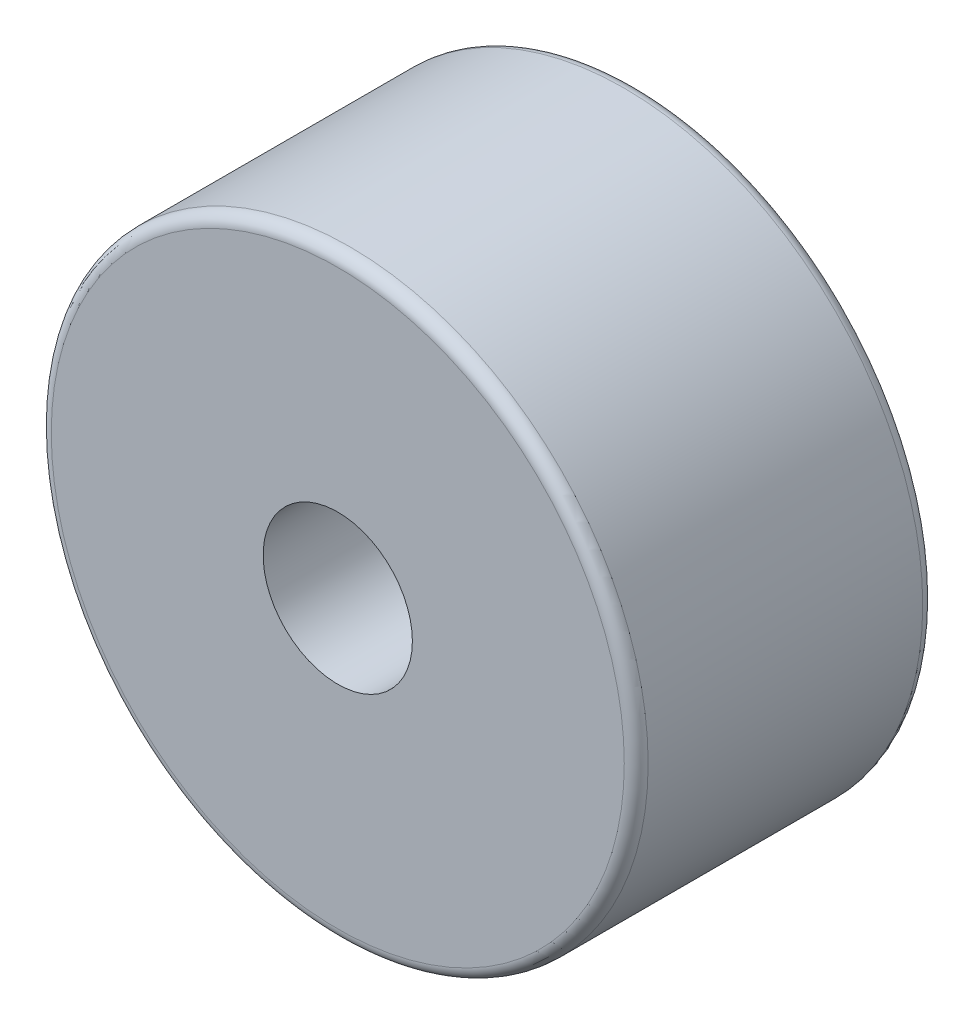
ISO-10303-21;
HEADER;
FILE_DESCRIPTION(('STEP AP214'),'2;1');
FILE_NAME('part.step','',(''),(''),'','','');
FILE_SCHEMA(('AUTOMOTIVE_DESIGN { 1 0 10303 214 1 1 1 1 }'));
ENDSEC;
DATA;
#1=APPLICATION_CONTEXT('core data for automotive mechanical design processes');
#2=APPLICATION_PROTOCOL_DEFINITION('international standard','automotive_design',2000,#1);
#3=PRODUCT_CONTEXT('',#1,'mechanical');
#4=PRODUCT('Part','Part','',(#3));
#5=PRODUCT_RELATED_PRODUCT_CATEGORY('part','',(#4));
#6=PRODUCT_DEFINITION_FORMATION('','',#4);
#7=PRODUCT_DEFINITION_CONTEXT('part definition',#1,'design');
#8=PRODUCT_DEFINITION('design','',#6,#7);
#9=PRODUCT_DEFINITION_SHAPE('','',#8);
#10=(LENGTH_UNIT() NAMED_UNIT(*) SI_UNIT(.MILLI.,.METRE.));
#11=(NAMED_UNIT(*) PLANE_ANGLE_UNIT() SI_UNIT($,.RADIAN.));
#12=(NAMED_UNIT(*) SI_UNIT($,.STERADIAN.) SOLID_ANGLE_UNIT());
#13=UNCERTAINTY_MEASURE_WITH_UNIT(LENGTH_MEASURE(1.E-05),#10,'distance_accuracy_value','');
#14=(GEOMETRIC_REPRESENTATION_CONTEXT(3) GLOBAL_UNCERTAINTY_ASSIGNED_CONTEXT((#13)) GLOBAL_UNIT_ASSIGNED_CONTEXT((#10,
#11,#12)) REPRESENTATION_CONTEXT('',''));
#15=CARTESIAN_POINT('',(0.,0.,0.));
#16=DIRECTION('',(0.,0.,1.));
#17=DIRECTION('',(1.,0.,0.));
#18=AXIS2_PLACEMENT_3D('',#15,#16,#17);
#19=CARTESIAN_POINT('',(0.,0.,0.));
#20=DIRECTION('',(0.,0.,1.));
#21=DIRECTION('',(1.,0.,0.));
#22=AXIS2_PLACEMENT_3D('',#19,#20,#21);
#23=CYLINDRICAL_SURFACE('',#22,1.5875);
#24=CARTESIAN_POINT('',(0.,0.,-2.38125));
#25=DIRECTION('',(0.,0.,1.));
#26=DIRECTION('',(1.,0.,0.));
#27=AXIS2_PLACEMENT_3D('',#24,#25,#26);
#28=CIRCLE('',#27,1.5875);
#29=CARTESIAN_POINT('',(1.5875,0.,-2.38125));
#30=VERTEX_POINT('',#29);
#31=EDGE_CURVE('E51',#30,#30,#28,.T.);
#32=ORIENTED_EDGE('',*,*,#31,.F.);
#33=EDGE_LOOP('',(#32));
#34=FACE_BOUND('',#33,.T.);
#35=CARTESIAN_POINT('',(0.,0.,0.));
#36=DIRECTION('',(0.,0.,1.));
#37=DIRECTION('',(1.,0.,0.));
#38=AXIS2_PLACEMENT_3D('',#35,#36,#37);
#39=CIRCLE('',#38,1.5875);
#40=CARTESIAN_POINT('',(1.5875,0.,0.));
#41=VERTEX_POINT('',#40);
#42=EDGE_CURVE('E60',#41,#41,#39,.T.);
#43=ORIENTED_EDGE('',*,*,#42,.T.);
#44=EDGE_LOOP('',(#43));
#45=FACE_BOUND('',#44,.T.);
#46=ADVANCED_FACE('F31',(#34,#45),#23,.F.);
#47=CARTESIAN_POINT('',(-1.5875,0.,-2.38125));
#48=DIRECTION('',(0.,0.,1.));
#49=DIRECTION('',(1.,0.,0.));
#50=AXIS2_PLACEMENT_3D('',#47,#48,#49);
#51=PLANE('',#50);
#52=CARTESIAN_POINT('',(0.,0.,-2.38125));
#53=DIRECTION('',(0.,0.,1.));
#54=DIRECTION('',(1.,0.,0.));
#55=AXIS2_PLACEMENT_3D('',#52,#53,#54);
#56=CIRCLE('',#55,2.9718);
#57=CARTESIAN_POINT('',(2.9718,0.,-2.38125));
#58=VERTEX_POINT('',#57);
#59=EDGE_CURVE('E54',#58,#58,#56,.T.);
#60=ORIENTED_EDGE('',*,*,#59,.F.);
#61=EDGE_LOOP('',(#60));
#62=FACE_BOUND('',#61,.T.);
#63=ORIENTED_EDGE('',*,*,#31,.T.);
#64=EDGE_LOOP('',(#63));
#65=FACE_BOUND('',#64,.T.);
#66=ADVANCED_FACE('F79',(#62,#65),#51,.F.);
#67=CARTESIAN_POINT('',(0.,0.,0.));
#68=DIRECTION('',(0.,0.,1.));
#69=DIRECTION('',(1.,0.,0.));
#70=AXIS2_PLACEMENT_3D('',#67,#68,#69);
#71=CYLINDRICAL_SURFACE('',#70,2.9718);
#72=CARTESIAN_POINT('',(0.,0.,-6.35));
#73=DIRECTION('',(0.,0.,1.));
#74=DIRECTION('',(1.,0.,0.));
#75=AXIS2_PLACEMENT_3D('',#72,#73,#74);
#76=CIRCLE('',#75,2.9718);
#77=CARTESIAN_POINT('',(2.9718,0.,-6.35));
#78=VERTEX_POINT('',#77);
#79=EDGE_CURVE('E57',#78,#78,#76,.T.);
#80=ORIENTED_EDGE('',*,*,#79,.F.);
#81=EDGE_LOOP('',(#80));
#82=FACE_BOUND('',#81,.T.);
#83=ORIENTED_EDGE('',*,*,#59,.T.);
#84=EDGE_LOOP('',(#83));
#85=FACE_BOUND('',#84,.T.);
#86=ADVANCED_FACE('F85',(#82,#85),#71,.F.);
#87=CARTESIAN_POINT('',(-6.35,0.,-6.35));
#88=DIRECTION('',(0.,0.,1.));
#89=DIRECTION('',(1.,0.,0.));
#90=AXIS2_PLACEMENT_3D('',#87,#88,#89);
#91=PLANE('',#90);
#92=CARTESIAN_POINT('',(0.,0.,-6.35));
#93=DIRECTION('',(0.,0.,1.));
#94=DIRECTION('',(1.,0.,0.));
#95=AXIS2_PLACEMENT_3D('',#92,#93,#94);
#96=CIRCLE('',#95,6.096);
#97=CARTESIAN_POINT('',(6.096,0.,-6.35));
#98=VERTEX_POINT('',#97);
#99=EDGE_CURVE('E10',#98,#98,#96,.F.);
#100=ORIENTED_EDGE('',*,*,#99,.T.);
#101=EDGE_LOOP('',(#100));
#102=FACE_BOUND('',#101,.T.);
#103=ORIENTED_EDGE('',*,*,#79,.T.);
#104=EDGE_LOOP('',(#103));
#105=FACE_BOUND('',#104,.T.);
#106=ADVANCED_FACE('F76',(#102,#105),#91,.F.);
#107=CARTESIAN_POINT('',(0.,0.,0.));
#108=DIRECTION('',(0.,0.,1.));
#109=DIRECTION('',(1.,0.,0.));
#110=AXIS2_PLACEMENT_3D('',#107,#108,#109);
#111=CYLINDRICAL_SURFACE('',#110,6.35);
#112=CARTESIAN_POINT('',(0.,0.,-0.254));
#113=DIRECTION('',(0.,0.,-1.));
#114=DIRECTION('',(-1.,0.,0.));
#115=AXIS2_PLACEMENT_3D('',#112,#113,#114);
#116=CIRCLE('',#115,6.35);
#117=CARTESIAN_POINT('',(-6.35,0.,-0.254));
#118=VERTEX_POINT('',#117);
#119=EDGE_CURVE('E38',#118,#118,#116,.T.);
#120=ORIENTED_EDGE('',*,*,#119,.T.);
#121=EDGE_LOOP('',(#120));
#122=FACE_BOUND('',#121,.T.);
#123=CARTESIAN_POINT('',(0.,0.,-6.096));
#124=DIRECTION('',(0.,0.,1.));
#125=DIRECTION('',(1.,0.,0.));
#126=AXIS2_PLACEMENT_3D('',#123,#124,#125);
#127=CIRCLE('',#126,6.35);
#128=CARTESIAN_POINT('',(6.35,0.,-6.096));
#129=VERTEX_POINT('',#128);
#130=EDGE_CURVE('E42',#129,#129,#127,.T.);
#131=ORIENTED_EDGE('',*,*,#130,.T.);
#132=EDGE_LOOP('',(#131));
#133=FACE_BOUND('',#132,.T.);
#134=ADVANCED_FACE('F68',(#122,#133),#111,.T.);
#135=CARTESIAN_POINT('',(-1.5875,0.,0.));
#136=DIRECTION('',(0.,0.,-1.));
#137=DIRECTION('',(-1.,0.,0.));
#138=AXIS2_PLACEMENT_3D('',#135,#136,#137);
#139=PLANE('',#138);
#140=CARTESIAN_POINT('',(0.,0.,0.));
#141=DIRECTION('',(0.,0.,-1.));
#142=DIRECTION('',(-1.,0.,0.));
#143=AXIS2_PLACEMENT_3D('',#140,#141,#142);
#144=CIRCLE('',#143,6.096);
#145=CARTESIAN_POINT('',(-6.096,0.,0.));
#146=VERTEX_POINT('',#145);
#147=EDGE_CURVE('E46',#146,#146,#144,.F.);
#148=ORIENTED_EDGE('',*,*,#147,.T.);
#149=EDGE_LOOP('',(#148));
#150=FACE_BOUND('',#149,.T.);
#151=ORIENTED_EDGE('',*,*,#42,.F.);
#152=EDGE_LOOP('',(#151));
#153=FACE_BOUND('',#152,.T.);
#154=ADVANCED_FACE('F65',(#150,#153),#139,.F.);
#155=CARTESIAN_POINT('',(0.,0.,-0.254));
#156=DIRECTION('',(0.,0.,-1.));
#157=DIRECTION('',(-1.,0.,0.));
#158=AXIS2_PLACEMENT_3D('',#155,#156,#157);
#159=TOROIDAL_SURFACE('',#158,6.096,0.254);
#160=ORIENTED_EDGE('',*,*,#119,.F.);
#161=EDGE_LOOP('',(#160));
#162=FACE_BOUND('',#161,.T.);
#163=ORIENTED_EDGE('',*,*,#147,.F.);
#164=EDGE_LOOP('',(#163));
#165=FACE_BOUND('',#164,.T.);
#166=ADVANCED_FACE('F67',(#162,#165),#159,.T.);
#167=CARTESIAN_POINT('',(0.,0.,-6.096));
#168=DIRECTION('',(0.,0.,1.));
#169=DIRECTION('',(1.,0.,0.));
#170=AXIS2_PLACEMENT_3D('',#167,#168,#169);
#171=TOROIDAL_SURFACE('',#170,6.096,0.254);
#172=ORIENTED_EDGE('',*,*,#99,.F.);
#173=EDGE_LOOP('',(#172));
#174=FACE_BOUND('',#173,.T.);
#175=ORIENTED_EDGE('',*,*,#130,.F.);
#176=EDGE_LOOP('',(#175));
#177=FACE_BOUND('',#176,.T.);
#178=ADVANCED_FACE('F33',(#174,#177),#171,.T.);
#179=CLOSED_SHELL('',(#46,#66,#86,#106,#134,#154,#166,#178));
#180=MANIFOLD_SOLID_BREP('B2',#179);
#181=ADVANCED_BREP_SHAPE_REPRESENTATION('',(#18,#180),#14);
#182=SHAPE_DEFINITION_REPRESENTATION(#9,#181);
ENDSEC;
END-ISO-10303-21;
